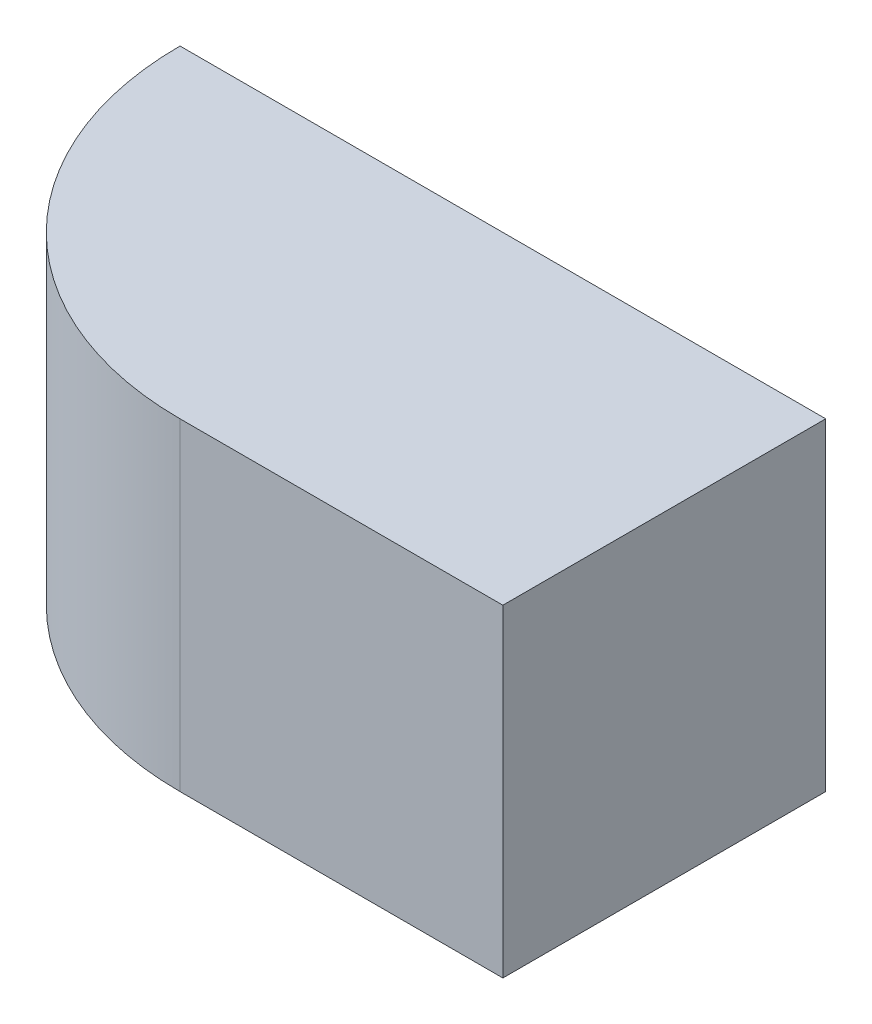
ISO-10303-21;
HEADER;
FILE_DESCRIPTION(('STEP AP214'),'2;1');
FILE_NAME('part.step','',(''),(''),'','','');
FILE_SCHEMA(('AUTOMOTIVE_DESIGN { 1 0 10303 214 1 1 1 1 }'));
ENDSEC;
DATA;
#1=APPLICATION_CONTEXT('core data for automotive mechanical design processes');
#2=APPLICATION_PROTOCOL_DEFINITION('international standard','automotive_design',2000,#1);
#3=PRODUCT_CONTEXT('',#1,'mechanical');
#4=PRODUCT('Part','Part','',(#3));
#5=PRODUCT_RELATED_PRODUCT_CATEGORY('part','',(#4));
#6=PRODUCT_DEFINITION_FORMATION('','',#4);
#7=PRODUCT_DEFINITION_CONTEXT('part definition',#1,'design');
#8=PRODUCT_DEFINITION('design','',#6,#7);
#9=PRODUCT_DEFINITION_SHAPE('','',#8);
#10=(LENGTH_UNIT() NAMED_UNIT(*) SI_UNIT(.MILLI.,.METRE.));
#11=(NAMED_UNIT(*) PLANE_ANGLE_UNIT() SI_UNIT($,.RADIAN.));
#12=(NAMED_UNIT(*) SI_UNIT($,.STERADIAN.) SOLID_ANGLE_UNIT());
#13=UNCERTAINTY_MEASURE_WITH_UNIT(LENGTH_MEASURE(1.E-05),#10,'distance_accuracy_value','');
#14=(GEOMETRIC_REPRESENTATION_CONTEXT(3) GLOBAL_UNCERTAINTY_ASSIGNED_CONTEXT((#13)) GLOBAL_UNIT_ASSIGNED_CONTEXT((#10,
#11,#12)) REPRESENTATION_CONTEXT('',''));
#15=CARTESIAN_POINT('',(0.,0.,0.));
#16=DIRECTION('',(0.,0.,1.));
#17=DIRECTION('',(1.,0.,0.));
#18=AXIS2_PLACEMENT_3D('',#15,#16,#17);
#19=CARTESIAN_POINT('',(-2.00000002980232,-2.75000013038516,2.));
#20=DIRECTION('',(0.,0.,1.));
#21=DIRECTION('',(1.,0.,0.));
#22=AXIS2_PLACEMENT_3D('',#19,#20,#21);
#23=PLANE('',#22);
#24=DIRECTION('',(-1.,0.,0.));
#25=VECTOR('',#24,1.);
#26=CARTESIAN_POINT('',(-1.50000002235174,-3.00000013411045,2.));
#27=LINE('',#26,#25);
#28=CARTESIAN_POINT('',(-1.50000002235174,-3.00000013411045,2.));
#29=VERTEX_POINT('',#28);
#30=CARTESIAN_POINT('',(-2.5000000372529,-3.00000013411045,2.));
#31=VERTEX_POINT('',#30);
#32=EDGE_CURVE('E78',#29,#31,#27,.T.);
#33=ORIENTED_EDGE('',*,*,#32,.T.);
#34=DIRECTION('',(0.,1.,0.));
#35=VECTOR('',#34,1.);
#36=CARTESIAN_POINT('',(-2.5000000372529,-3.00000013411045,2.));
#37=LINE('',#36,#35);
#38=CARTESIAN_POINT('',(-2.5000000372529,-2.50000012665987,2.));
#39=VERTEX_POINT('',#38);
#40=EDGE_CURVE('E21',#31,#39,#37,.T.);
#41=ORIENTED_EDGE('',*,*,#40,.T.);
#42=DIRECTION('',(1.,0.,0.));
#43=VECTOR('',#42,1.);
#44=CARTESIAN_POINT('',(-2.5000000372529,-2.50000012665987,2.));
#45=LINE('',#44,#43);
#46=CARTESIAN_POINT('',(-1.50000002235174,-2.50000012665987,2.));
#47=VERTEX_POINT('',#46);
#48=EDGE_CURVE('E65',#39,#47,#45,.T.);
#49=ORIENTED_EDGE('',*,*,#48,.T.);
#50=DIRECTION('',(0.,-1.,0.));
#51=VECTOR('',#50,1.);
#52=CARTESIAN_POINT('',(-1.50000002235174,-2.50000012665987,2.));
#53=LINE('',#52,#51);
#54=EDGE_CURVE('E28',#47,#29,#53,.T.);
#55=ORIENTED_EDGE('',*,*,#54,.T.);
#56=EDGE_LOOP('',(#33,#41,#49,#55));
#57=FACE_BOUND('',#56,.T.);
#58=ADVANCED_FACE('F17',(#57),#23,.F.);
#59=CARTESIAN_POINT('',(-2.00000002980232,-2.75000013038516,2.5));
#60=DIRECTION('',(0.,0.,1.));
#61=DIRECTION('',(1.,0.,0.));
#62=AXIS2_PLACEMENT_3D('',#59,#60,#61);
#63=PLANE('',#62);
#64=DIRECTION('',(0.,1.,0.));
#65=VECTOR('',#64,1.);
#66=CARTESIAN_POINT('',(-2.0000000372529,-2.62500012852251,2.5));
#67=LINE('',#66,#65);
#68=CARTESIAN_POINT('',(-2.0000000372529,-3.00000013411045,2.5));
#69=VERTEX_POINT('',#68);
#70=CARTESIAN_POINT('',(-2.0000000372529,-2.50000012665987,2.5));
#71=VERTEX_POINT('',#70);
#72=EDGE_CURVE('E84',#69,#71,#67,.T.);
#73=ORIENTED_EDGE('',*,*,#72,.F.);
#74=DIRECTION('',(1.,0.,0.));
#75=VECTOR('',#74,1.);
#76=CARTESIAN_POINT('',(-1.50000002235174,-3.00000013411045,2.5));
#77=LINE('',#76,#75);
#78=CARTESIAN_POINT('',(-1.50000002235174,-3.00000013411045,2.5));
#79=VERTEX_POINT('',#78);
#80=EDGE_CURVE('E95',#69,#79,#77,.T.);
#81=ORIENTED_EDGE('',*,*,#80,.T.);
#82=DIRECTION('',(0.,1.,0.));
#83=VECTOR('',#82,1.);
#84=CARTESIAN_POINT('',(-1.50000002235174,-2.50000012665987,2.5));
#85=LINE('',#84,#83);
#86=CARTESIAN_POINT('',(-1.50000002235174,-2.50000012665987,2.5));
#87=VERTEX_POINT('',#86);
#88=EDGE_CURVE('E11',#79,#87,#85,.T.);
#89=ORIENTED_EDGE('',*,*,#88,.T.);
#90=DIRECTION('',(-1.,0.,0.));
#91=VECTOR('',#90,1.);
#92=CARTESIAN_POINT('',(-2.5000000372529,-2.50000012665987,2.5));
#93=LINE('',#92,#91);
#94=EDGE_CURVE('E98',#87,#71,#93,.T.);
#95=ORIENTED_EDGE('',*,*,#94,.T.);
#96=EDGE_LOOP('',(#73,#81,#89,#95));
#97=FACE_BOUND('',#96,.T.);
#98=ADVANCED_FACE('F118',(#97),#63,.T.);
#99=CARTESIAN_POINT('',(-1.50000002235174,-3.00000013411045,2.));
#100=DIRECTION('',(1.,0.,0.));
#101=DIRECTION('',(0.,1.,0.));
#102=AXIS2_PLACEMENT_3D('',#99,#100,#101);
#103=PLANE('',#102);
#104=ORIENTED_EDGE('',*,*,#54,.F.);
#105=DIRECTION('',(0.,0.,1.));
#106=VECTOR('',#105,1.);
#107=CARTESIAN_POINT('',(-1.50000002235174,-2.50000012665987,2.));
#108=LINE('',#107,#106);
#109=EDGE_CURVE('E72',#47,#87,#108,.T.);
#110=ORIENTED_EDGE('',*,*,#109,.T.);
#111=ORIENTED_EDGE('',*,*,#88,.F.);
#112=DIRECTION('',(0.,0.,1.));
#113=VECTOR('',#112,1.);
#114=CARTESIAN_POINT('',(-1.50000002235174,-3.00000013411045,2.));
#115=LINE('',#114,#113);
#116=EDGE_CURVE('E99',#29,#79,#115,.T.);
#117=ORIENTED_EDGE('',*,*,#116,.F.);
#118=EDGE_LOOP('',(#104,#110,#111,#117));
#119=FACE_BOUND('',#118,.T.);
#120=ADVANCED_FACE('F117',(#119),#103,.T.);
#121=CARTESIAN_POINT('',(-1.50000002235174,-2.50000012665987,2.));
#122=DIRECTION('',(0.,1.,0.));
#123=DIRECTION('',(1.,0.,0.));
#124=AXIS2_PLACEMENT_3D('',#121,#122,#123);
#125=PLANE('',#124);
#126=CARTESIAN_POINT('',(-2.0000000372529,-2.50000012665987,2.));
#127=DIRECTION('',(0.,-1.,0.));
#128=DIRECTION('',(-0.707106781186548,0.,0.707106781186548));
#129=AXIS2_PLACEMENT_3D('',#126,#127,#128);
#130=CIRCLE('',#129,0.5);
#131=EDGE_CURVE('E70',#71,#39,#130,.T.);
#132=ORIENTED_EDGE('',*,*,#131,.F.);
#133=ORIENTED_EDGE('',*,*,#94,.F.);
#134=ORIENTED_EDGE('',*,*,#109,.F.);
#135=ORIENTED_EDGE('',*,*,#48,.F.);
#136=EDGE_LOOP('',(#132,#133,#134,#135));
#137=FACE_BOUND('',#136,.T.);
#138=ADVANCED_FACE('F67',(#137),#125,.T.);
#139=CARTESIAN_POINT('',(-2.5000000372529,-3.00000013411045,2.));
#140=DIRECTION('',(0.,-1.,0.));
#141=DIRECTION('',(0.,0.,-1.));
#142=AXIS2_PLACEMENT_3D('',#139,#140,#141);
#143=PLANE('',#142);
#144=CARTESIAN_POINT('',(-2.0000000372529,-3.00000013411045,2.));
#145=DIRECTION('',(0.,1.,0.));
#146=DIRECTION('',(-0.707106781186548,0.,0.707106781186548));
#147=AXIS2_PLACEMENT_3D('',#144,#145,#146);
#148=CIRCLE('',#147,0.5);
#149=EDGE_CURVE('E91',#31,#69,#148,.T.);
#150=ORIENTED_EDGE('',*,*,#149,.F.);
#151=ORIENTED_EDGE('',*,*,#32,.F.);
#152=ORIENTED_EDGE('',*,*,#116,.T.);
#153=ORIENTED_EDGE('',*,*,#80,.F.);
#154=EDGE_LOOP('',(#150,#151,#152,#153));
#155=FACE_BOUND('',#154,.T.);
#156=ADVANCED_FACE('F116',(#155),#143,.T.);
#157=CARTESIAN_POINT('',(-2.0000000372529,-2.62500012852251,2.));
#158=DIRECTION('',(0.,-1.,0.));
#159=DIRECTION('',(-0.707106781186548,0.,0.707106781186548));
#160=AXIS2_PLACEMENT_3D('',#157,#158,#159);
#161=CYLINDRICAL_SURFACE('',#160,0.5);
#162=ORIENTED_EDGE('',*,*,#149,.T.);
#163=ORIENTED_EDGE('',*,*,#72,.T.);
#164=ORIENTED_EDGE('',*,*,#131,.T.);
#165=ORIENTED_EDGE('',*,*,#40,.F.);
#166=EDGE_LOOP('',(#162,#163,#164,#165));
#167=FACE_BOUND('',#166,.T.);
#168=ADVANCED_FACE('F19',(#167),#161,.T.);
#169=CLOSED_SHELL('',(#58,#98,#120,#138,#156,#168));
#170=MANIFOLD_SOLID_BREP('B1',#169);
#171=ADVANCED_BREP_SHAPE_REPRESENTATION('',(#18,#170),#14);
#172=SHAPE_DEFINITION_REPRESENTATION(#9,#171);
ENDSEC;
END-ISO-10303-21;
